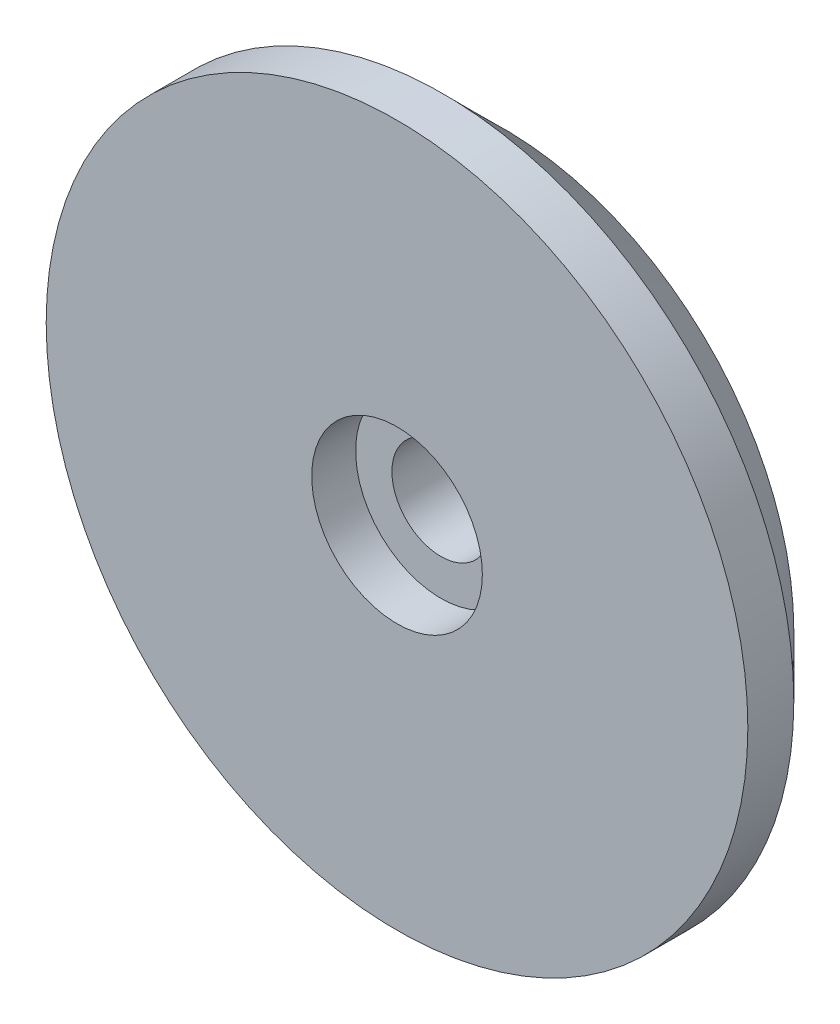
ISO-10303-21;
HEADER;
FILE_DESCRIPTION(('STEP AP214'),'2;1');
FILE_NAME('part.step','',(''),(''),'','','');
FILE_SCHEMA(('AUTOMOTIVE_DESIGN { 1 0 10303 214 1 1 1 1 }'));
ENDSEC;
DATA;
#1=APPLICATION_CONTEXT('core data for automotive mechanical design processes');
#2=APPLICATION_PROTOCOL_DEFINITION('international standard','automotive_design',2000,#1);
#3=PRODUCT_CONTEXT('',#1,'mechanical');
#4=PRODUCT('Part','Part','',(#3));
#5=PRODUCT_RELATED_PRODUCT_CATEGORY('part','',(#4));
#6=PRODUCT_DEFINITION_FORMATION('','',#4);
#7=PRODUCT_DEFINITION_CONTEXT('part definition',#1,'design');
#8=PRODUCT_DEFINITION('design','',#6,#7);
#9=PRODUCT_DEFINITION_SHAPE('','',#8);
#10=(LENGTH_UNIT() NAMED_UNIT(*) SI_UNIT(.MILLI.,.METRE.));
#11=(NAMED_UNIT(*) PLANE_ANGLE_UNIT() SI_UNIT($,.RADIAN.));
#12=(NAMED_UNIT(*) SI_UNIT($,.STERADIAN.) SOLID_ANGLE_UNIT());
#13=UNCERTAINTY_MEASURE_WITH_UNIT(LENGTH_MEASURE(1.E-05),#10,'distance_accuracy_value','');
#14=(GEOMETRIC_REPRESENTATION_CONTEXT(3) GLOBAL_UNCERTAINTY_ASSIGNED_CONTEXT((#13)) GLOBAL_UNIT_ASSIGNED_CONTEXT((#10,
#11,#12)) REPRESENTATION_CONTEXT('',''));
#15=CARTESIAN_POINT('',(0.,0.,0.));
#16=DIRECTION('',(0.,0.,1.));
#17=DIRECTION('',(1.,0.,0.));
#18=AXIS2_PLACEMENT_3D('',#15,#16,#17);
#19=CARTESIAN_POINT('',(0.,0.,-460.737012795732));
#20=DIRECTION('',(0.,0.,-1.));
#21=DIRECTION('',(-1.,0.,0.));
#22=AXIS2_PLACEMENT_3D('',#19,#20,#21);
#23=CYLINDRICAL_SURFACE('',#22,1.8);
#24=CARTESIAN_POINT('',(0.,0.,-469.924512795732));
#25=DIRECTION('',(0.,0.,-1.));
#26=DIRECTION('',(-1.,0.,0.));
#27=AXIS2_PLACEMENT_3D('',#24,#25,#26);
#28=CIRCLE('',#27,1.8);
#29=CARTESIAN_POINT('',(-1.8,0.,-469.924512795732));
#30=VERTEX_POINT('',#29);
#31=EDGE_CURVE('E52',#30,#30,#28,.T.);
#32=ORIENTED_EDGE('',*,*,#31,.T.);
#33=EDGE_LOOP('',(#32));
#34=FACE_BOUND('',#33,.T.);
#35=CARTESIAN_POINT('',(0.,0.,-467.599512795732));
#36=DIRECTION('',(0.,0.,1.));
#37=DIRECTION('',(1.,0.,0.));
#38=AXIS2_PLACEMENT_3D('',#35,#36,#37);
#39=CIRCLE('',#38,1.8);
#40=CARTESIAN_POINT('',(1.8,0.,-467.599512795732));
#41=VERTEX_POINT('',#40);
#42=EDGE_CURVE('E50',#41,#41,#39,.F.);
#43=ORIENTED_EDGE('',*,*,#42,.F.);
#44=EDGE_LOOP('',(#43));
#45=FACE_BOUND('',#44,.T.);
#46=ADVANCED_FACE('F32',(#34,#45),#23,.F.);
#47=CARTESIAN_POINT('',(0.,0.,-469.924512795732));
#48=DIRECTION('',(0.,0.,1.));
#49=DIRECTION('',(1.,0.,0.));
#50=AXIS2_PLACEMENT_3D('',#47,#48,#49);
#51=CYLINDRICAL_SURFACE('',#50,12.88587972129);
#52=CARTESIAN_POINT('',(0.,0.,-467.674512795732));
#53=DIRECTION('',(0.,0.,1.));
#54=DIRECTION('',(1.,0.,0.));
#55=AXIS2_PLACEMENT_3D('',#52,#53,#54);
#56=CIRCLE('',#55,12.88587972129);
#57=CARTESIAN_POINT('',(12.88587972129,0.,-467.674512795732));
#58=VERTEX_POINT('',#57);
#59=EDGE_CURVE('E39',#58,#58,#56,.T.);
#60=ORIENTED_EDGE('',*,*,#59,.T.);
#61=EDGE_LOOP('',(#60));
#62=FACE_BOUND('',#61,.T.);
#63=CARTESIAN_POINT('',(0.,0.,-465.987012795732));
#64=DIRECTION('',(0.,0.,1.));
#65=DIRECTION('',(1.,0.,0.));
#66=AXIS2_PLACEMENT_3D('',#63,#64,#65);
#67=CIRCLE('',#66,12.88587972129);
#68=CARTESIAN_POINT('',(12.88587972129,0.,-465.987012795732));
#69=VERTEX_POINT('',#68);
#70=EDGE_CURVE('E43',#69,#69,#67,.T.);
#71=ORIENTED_EDGE('',*,*,#70,.F.);
#72=EDGE_LOOP('',(#71));
#73=FACE_BOUND('',#72,.T.);
#74=ADVANCED_FACE('F91',(#62,#73),#51,.T.);
#75=CARTESIAN_POINT('',(0.,0.,-469.924512795732));
#76=DIRECTION('',(0.,0.,1.));
#77=DIRECTION('',(1.,0.,0.));
#78=AXIS2_PLACEMENT_3D('',#75,#76,#77);
#79=PLANE('',#78);
#80=CARTESIAN_POINT('',(0.,0.,-469.924512795732));
#81=DIRECTION('',(0.,0.,1.));
#82=DIRECTION('',(1.,0.,0.));
#83=AXIS2_PLACEMENT_3D('',#80,#81,#82);
#84=CIRCLE('',#83,10.6358797212901);
#85=CARTESIAN_POINT('',(10.6358797212901,0.,-469.924512795732));
#86=VERTEX_POINT('',#85);
#87=EDGE_CURVE('E10',#86,#86,#84,.F.);
#88=ORIENTED_EDGE('',*,*,#87,.T.);
#89=EDGE_LOOP('',(#88));
#90=FACE_BOUND('',#89,.T.);
#91=CARTESIAN_POINT('',(0.,0.,-469.924512795732));
#92=DIRECTION('',(0.,0.,-1.));
#93=DIRECTION('',(-1.,0.,0.));
#94=AXIS2_PLACEMENT_3D('',#91,#92,#93);
#95=CIRCLE('',#94,10.5593505862207);
#96=CARTESIAN_POINT('',(-10.5593505862207,0.,-469.924512795732));
#97=VERTEX_POINT('',#96);
#98=EDGE_CURVE('E55',#97,#97,#95,.T.);
#99=ORIENTED_EDGE('',*,*,#98,.F.);
#100=EDGE_LOOP('',(#99));
#101=FACE_BOUND('',#100,.T.);
#102=ADVANCED_FACE('F87',(#90,#101),#79,.F.);
#103=CARTESIAN_POINT('',(0.,0.,-465.987012795732));
#104=DIRECTION('',(0.,0.,1.));
#105=DIRECTION('',(1.,0.,0.));
#106=AXIS2_PLACEMENT_3D('',#103,#104,#105);
#107=PLANE('',#106);
#108=CARTESIAN_POINT('',(0.,0.,-465.987012795732));
#109=DIRECTION('',(0.,0.,1.));
#110=DIRECTION('',(1.,0.,0.));
#111=AXIS2_PLACEMENT_3D('',#108,#109,#110);
#112=CIRCLE('',#111,3.13400905950654);
#113=CARTESIAN_POINT('',(3.13400905950654,0.,-465.987012795732));
#114=VERTEX_POINT('',#113);
#115=EDGE_CURVE('E68',#114,#114,#112,.T.);
#116=ORIENTED_EDGE('',*,*,#115,.F.);
#117=EDGE_LOOP('',(#116));
#118=FACE_BOUND('',#117,.T.);
#119=ORIENTED_EDGE('',*,*,#70,.T.);
#120=EDGE_LOOP('',(#119));
#121=FACE_BOUND('',#120,.T.);
#122=ADVANCED_FACE('F83',(#118,#121),#107,.T.);
#123=CARTESIAN_POINT('',(0.,0.,-468.237012795732));
#124=DIRECTION('',(0.,0.,-1.));
#125=DIRECTION('',(-1.,0.,0.));
#126=AXIS2_PLACEMENT_3D('',#123,#124,#125);
#127=CYLINDRICAL_SURFACE('',#126,10.5593505862207);
#128=CARTESIAN_POINT('',(0.,0.,-468.237012795732));
#129=DIRECTION('',(0.,0.,-1.));
#130=DIRECTION('',(-1.,0.,0.));
#131=AXIS2_PLACEMENT_3D('',#128,#129,#130);
#132=CIRCLE('',#131,10.5593505862207);
#133=CARTESIAN_POINT('',(-10.5593505862207,0.,-468.237012795732));
#134=VERTEX_POINT('',#133);
#135=EDGE_CURVE('E47',#134,#134,#132,.T.);
#136=ORIENTED_EDGE('',*,*,#135,.F.);
#137=EDGE_LOOP('',(#136));
#138=FACE_BOUND('',#137,.T.);
#139=ORIENTED_EDGE('',*,*,#98,.T.);
#140=EDGE_LOOP('',(#139));
#141=FACE_BOUND('',#140,.T.);
#142=ADVANCED_FACE('F86',(#138,#141),#127,.F.);
#143=CARTESIAN_POINT('',(0.,0.,-468.237012795732));
#144=DIRECTION('',(0.,0.,-1.));
#145=DIRECTION('',(-1.,0.,0.));
#146=AXIS2_PLACEMENT_3D('',#143,#144,#145);
#147=PLANE('',#146);
#148=CARTESIAN_POINT('',(0.,0.,-468.237012795732));
#149=DIRECTION('',(0.,0.,-1.));
#150=DIRECTION('',(-1.,0.,0.));
#151=AXIS2_PLACEMENT_3D('',#148,#149,#150);
#152=CIRCLE('',#151,4.2223305576223);
#153=CARTESIAN_POINT('',(-4.2223305576223,0.,-468.237012795732));
#154=VERTEX_POINT('',#153);
#155=EDGE_CURVE('E58',#154,#154,#152,.T.);
#156=ORIENTED_EDGE('',*,*,#155,.F.);
#157=EDGE_LOOP('',(#156));
#158=FACE_BOUND('',#157,.T.);
#159=ORIENTED_EDGE('',*,*,#135,.T.);
#160=EDGE_LOOP('',(#159));
#161=FACE_BOUND('',#160,.T.);
#162=ADVANCED_FACE('F104',(#158,#161),#147,.T.);
#163=CARTESIAN_POINT('',(0.,0.,-468.237012795732));
#164=DIRECTION('',(0.,0.,-1.));
#165=DIRECTION('',(-1.,0.,0.));
#166=AXIS2_PLACEMENT_3D('',#163,#164,#165);
#167=CYLINDRICAL_SURFACE('',#166,4.2223305576223);
#168=ORIENTED_EDGE('',*,*,#155,.T.);
#169=EDGE_LOOP('',(#168));
#170=FACE_BOUND('',#169,.T.);
#171=CARTESIAN_POINT('',(0.,0.,-469.924512795732));
#172=DIRECTION('',(0.,0.,-1.));
#173=DIRECTION('',(-1.,0.,0.));
#174=AXIS2_PLACEMENT_3D('',#171,#172,#173);
#175=CIRCLE('',#174,4.2223305576223);
#176=CARTESIAN_POINT('',(-4.2223305576223,0.,-469.924512795732));
#177=VERTEX_POINT('',#176);
#178=EDGE_CURVE('E61',#177,#177,#175,.T.);
#179=ORIENTED_EDGE('',*,*,#178,.F.);
#180=EDGE_LOOP('',(#179));
#181=FACE_BOUND('',#180,.T.);
#182=ADVANCED_FACE('F108',(#170,#181),#167,.T.);
#183=ORIENTED_EDGE('',*,*,#31,.F.);
#184=EDGE_LOOP('',(#183));
#185=FACE_BOUND('',#184,.T.);
#186=ORIENTED_EDGE('',*,*,#178,.T.);
#187=EDGE_LOOP('',(#186));
#188=FACE_BOUND('',#187,.T.);
#189=ADVANCED_FACE('F98',(#185,#188),#79,.F.);
#190=CARTESIAN_POINT('',(0.,0.,-467.599512795732));
#191=DIRECTION('',(0.,0.,1.));
#192=DIRECTION('',(1.,0.,0.));
#193=AXIS2_PLACEMENT_3D('',#190,#191,#192);
#194=PLANE('',#193);
#195=CARTESIAN_POINT('',(0.,0.,-467.599512795732));
#196=DIRECTION('',(0.,0.,1.));
#197=DIRECTION('',(1.,0.,0.));
#198=AXIS2_PLACEMENT_3D('',#195,#196,#197);
#199=CIRCLE('',#198,3.13400905950654);
#200=CARTESIAN_POINT('',(3.13400905950654,0.,-467.599512795732));
#201=VERTEX_POINT('',#200);
#202=EDGE_CURVE('E53',#201,#201,#199,.T.);
#203=ORIENTED_EDGE('',*,*,#202,.T.);
#204=EDGE_LOOP('',(#203));
#205=FACE_BOUND('',#204,.T.);
#206=ORIENTED_EDGE('',*,*,#42,.T.);
#207=EDGE_LOOP('',(#206));
#208=FACE_BOUND('',#207,.T.);
#209=ADVANCED_FACE('F74',(#205,#208),#194,.T.);
#210=CARTESIAN_POINT('',(0.,0.,-467.599512795732));
#211=DIRECTION('',(0.,0.,1.));
#212=DIRECTION('',(1.,0.,0.));
#213=AXIS2_PLACEMENT_3D('',#210,#211,#212);
#214=CYLINDRICAL_SURFACE('',#213,3.13400905950654);
#215=ORIENTED_EDGE('',*,*,#202,.F.);
#216=EDGE_LOOP('',(#215));
#217=FACE_BOUND('',#216,.T.);
#218=ORIENTED_EDGE('',*,*,#115,.T.);
#219=EDGE_LOOP('',(#218));
#220=FACE_BOUND('',#219,.T.);
#221=ADVANCED_FACE('F77',(#217,#220),#214,.F.);
#222=CARTESIAN_POINT('',(0.,0.,-467.674512795732));
#223=DIRECTION('',(0.,0.,1.));
#224=DIRECTION('',(1.,0.,0.));
#225=AXIS2_PLACEMENT_3D('',#222,#223,#224);
#226=CONICAL_SURFACE('',#225,12.88587972129,0.785398163397445);
#227=ORIENTED_EDGE('',*,*,#87,.F.);
#228=EDGE_LOOP('',(#227));
#229=FACE_BOUND('',#228,.T.);
#230=ORIENTED_EDGE('',*,*,#59,.F.);
#231=EDGE_LOOP('',(#230));
#232=FACE_BOUND('',#231,.T.);
#233=ADVANCED_FACE('F34',(#229,#232),#226,.T.);
#234=CLOSED_SHELL('',(#46,#74,#102,#122,#142,#162,#182,#189,#209,#221,#233));
#235=MANIFOLD_SOLID_BREP('B2',#234);
#236=ADVANCED_BREP_SHAPE_REPRESENTATION('',(#18,#235),#14);
#237=SHAPE_DEFINITION_REPRESENTATION(#9,#236);
ENDSEC;
END-ISO-10303-21;
